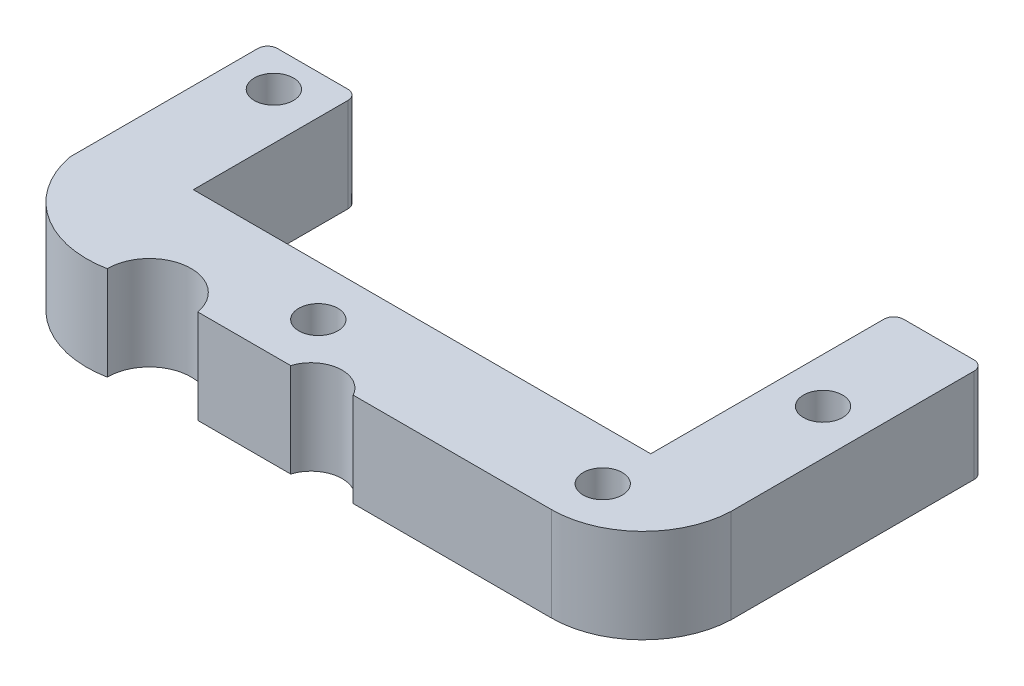
ISO-10303-21;
HEADER;
FILE_DESCRIPTION(('STEP AP214'),'2;1');
FILE_NAME('part.step','',(''),(''),'','','');
FILE_SCHEMA(('AUTOMOTIVE_DESIGN { 1 0 10303 214 1 1 1 1 }'));
ENDSEC;
DATA;
#1=APPLICATION_CONTEXT('core data for automotive mechanical design processes');
#2=APPLICATION_PROTOCOL_DEFINITION('international standard','automotive_design',2000,#1);
#3=PRODUCT_CONTEXT('',#1,'mechanical');
#4=PRODUCT('Part','Part','',(#3));
#5=PRODUCT_RELATED_PRODUCT_CATEGORY('part','',(#4));
#6=PRODUCT_DEFINITION_FORMATION('','',#4);
#7=PRODUCT_DEFINITION_CONTEXT('part definition',#1,'design');
#8=PRODUCT_DEFINITION('design','',#6,#7);
#9=PRODUCT_DEFINITION_SHAPE('','',#8);
#10=(LENGTH_UNIT() NAMED_UNIT(*) SI_UNIT(.MILLI.,.METRE.));
#11=(NAMED_UNIT(*) PLANE_ANGLE_UNIT() SI_UNIT($,.RADIAN.));
#12=(NAMED_UNIT(*) SI_UNIT($,.STERADIAN.) SOLID_ANGLE_UNIT());
#13=UNCERTAINTY_MEASURE_WITH_UNIT(LENGTH_MEASURE(1.E-05),#10,'distance_accuracy_value','');
#14=(GEOMETRIC_REPRESENTATION_CONTEXT(3) GLOBAL_UNCERTAINTY_ASSIGNED_CONTEXT((#13)) GLOBAL_UNIT_ASSIGNED_CONTEXT((#10,
#11,#12)) REPRESENTATION_CONTEXT('',''));
#15=CARTESIAN_POINT('',(0.,0.,0.));
#16=DIRECTION('',(0.,0.,1.));
#17=DIRECTION('',(1.,0.,0.));
#18=AXIS2_PLACEMENT_3D('',#15,#16,#17);
#19=CARTESIAN_POINT('',(4.6,4.8,0.));
#20=DIRECTION('',(1.,0.,0.));
#21=DIRECTION('',(0.,0.,-1.));
#22=AXIS2_PLACEMENT_3D('',#19,#20,#21);
#23=PLANE('',#22);
#24=DIRECTION('',(0.,0.,1.));
#25=VECTOR('',#24,1.);
#26=CARTESIAN_POINT('',(4.6,0.,0.));
#27=LINE('',#26,#25);
#28=CARTESIAN_POINT('',(4.6,0.,-9.60996632196429));
#29=VERTEX_POINT('',#28);
#30=CARTESIAN_POINT('',(4.6,0.,-1.71422987189018));
#31=VERTEX_POINT('',#30);
#32=EDGE_CURVE('E247',#29,#31,#27,.T.);
#33=ORIENTED_EDGE('',*,*,#32,.F.);
#34=DIRECTION('',(0.,-1.,0.));
#35=VECTOR('',#34,1.);
#36=CARTESIAN_POINT('',(4.6,4.8,-9.60996632196429));
#37=LINE('',#36,#35);
#38=CARTESIAN_POINT('',(4.6,4.8,-9.60996632196429));
#39=VERTEX_POINT('',#38);
#40=EDGE_CURVE('E54',#29,#39,#37,.F.);
#41=ORIENTED_EDGE('',*,*,#40,.T.);
#42=DIRECTION('',(0.,0.,1.));
#43=VECTOR('',#42,1.);
#44=CARTESIAN_POINT('',(4.6,4.8,0.));
#45=LINE('',#44,#43);
#46=CARTESIAN_POINT('',(4.6,4.8,-1.71422987189018));
#47=VERTEX_POINT('',#46);
#48=EDGE_CURVE('E196',#39,#47,#45,.T.);
#49=ORIENTED_EDGE('',*,*,#48,.T.);
#50=DIRECTION('',(0.,-1.,0.));
#51=VECTOR('',#50,1.);
#52=CARTESIAN_POINT('',(4.6,4.8,-1.71422987189018));
#53=LINE('',#52,#51);
#54=EDGE_CURVE('E246',#47,#31,#53,.T.);
#55=ORIENTED_EDGE('',*,*,#54,.T.);
#56=EDGE_LOOP('',(#33,#41,#49,#55));
#57=FACE_BOUND('',#56,.T.);
#58=ADVANCED_FACE('F45',(#57),#23,.T.);
#59=CARTESIAN_POINT('',(0.,4.8,-10.1099663219643));
#60=DIRECTION('',(0.,0.,-1.));
#61=DIRECTION('',(-1.,0.,0.));
#62=AXIS2_PLACEMENT_3D('',#59,#60,#61);
#63=PLANE('',#62);
#64=DIRECTION('',(1.,0.,0.));
#65=VECTOR('',#64,1.);
#66=CARTESIAN_POINT('',(0.,4.8,-10.1099663219643));
#67=LINE('',#66,#65);
#68=CARTESIAN_POINT('',(0.5,4.8,-10.1099663219643));
#69=VERTEX_POINT('',#68);
#70=CARTESIAN_POINT('',(4.1,4.8,-10.1099663219643));
#71=VERTEX_POINT('',#70);
#72=EDGE_CURVE('E192',#69,#71,#67,.T.);
#73=ORIENTED_EDGE('',*,*,#72,.T.);
#74=DIRECTION('',(0.,-1.,0.));
#75=VECTOR('',#74,1.);
#76=CARTESIAN_POINT('',(4.1,4.8,-10.1099663219643));
#77=LINE('',#76,#75);
#78=CARTESIAN_POINT('',(4.1,0.,-10.1099663219643));
#79=VERTEX_POINT('',#78);
#80=EDGE_CURVE('E372',#71,#79,#77,.T.);
#81=ORIENTED_EDGE('',*,*,#80,.T.);
#82=DIRECTION('',(1.,0.,0.));
#83=VECTOR('',#82,1.);
#84=CARTESIAN_POINT('',(0.,0.,-10.1099663219643));
#85=LINE('',#84,#83);
#86=CARTESIAN_POINT('',(0.5,0.,-10.1099663219643));
#87=VERTEX_POINT('',#86);
#88=EDGE_CURVE('E250',#87,#79,#85,.T.);
#89=ORIENTED_EDGE('',*,*,#88,.F.);
#90=DIRECTION('',(0.,-1.,0.));
#91=VECTOR('',#90,1.);
#92=CARTESIAN_POINT('',(0.5,4.8,-10.1099663219643));
#93=LINE('',#92,#91);
#94=EDGE_CURVE('E369',#87,#69,#93,.F.);
#95=ORIENTED_EDGE('',*,*,#94,.T.);
#96=EDGE_LOOP('',(#73,#81,#89,#95));
#97=FACE_BOUND('',#96,.T.);
#98=ADVANCED_FACE('F389',(#97),#63,.T.);
#99=CARTESIAN_POINT('',(0.,4.8,0.));
#100=DIRECTION('',(-1.,0.,0.));
#101=DIRECTION('',(0.,0.,1.));
#102=AXIS2_PLACEMENT_3D('',#99,#100,#101);
#103=PLANE('',#102);
#104=DIRECTION('',(0.,0.,-1.));
#105=VECTOR('',#104,1.);
#106=CARTESIAN_POINT('',(0.,4.8,0.));
#107=LINE('',#106,#105);
#108=CARTESIAN_POINT('',(0.,4.8,0.));
#109=VERTEX_POINT('',#108);
#110=CARTESIAN_POINT('',(0.,4.8,-9.60996632196429));
#111=VERTEX_POINT('',#110);
#112=EDGE_CURVE('E170',#109,#111,#107,.T.);
#113=ORIENTED_EDGE('',*,*,#112,.T.);
#114=DIRECTION('',(0.,-1.,0.));
#115=VECTOR('',#114,1.);
#116=CARTESIAN_POINT('',(0.,4.8,-9.60996632196429));
#117=LINE('',#116,#115);
#118=CARTESIAN_POINT('',(0.,0.,-9.60996632196429));
#119=VERTEX_POINT('',#118);
#120=EDGE_CURVE('E11',#111,#119,#117,.T.);
#121=ORIENTED_EDGE('',*,*,#120,.T.);
#122=DIRECTION('',(0.,0.,-1.));
#123=VECTOR('',#122,1.);
#124=CARTESIAN_POINT('',(0.,0.,0.));
#125=LINE('',#124,#123);
#126=CARTESIAN_POINT('',(0.,0.,0.));
#127=VERTEX_POINT('',#126);
#128=EDGE_CURVE('E173',#127,#119,#125,.T.);
#129=ORIENTED_EDGE('',*,*,#128,.F.);
#130=DIRECTION('',(0.,-1.,0.));
#131=VECTOR('',#130,1.);
#132=CARTESIAN_POINT('',(0.,4.8,0.));
#133=LINE('',#132,#131);
#134=EDGE_CURVE('E167',#109,#127,#133,.T.);
#135=ORIENTED_EDGE('',*,*,#134,.F.);
#136=EDGE_LOOP('',(#113,#121,#129,#135));
#137=FACE_BOUND('',#136,.T.);
#138=ADVANCED_FACE('F169',(#137),#103,.T.);
#139=CARTESIAN_POINT('',(4.93787484585662,4.8,-0.959460949687052));
#140=DIRECTION('',(0.,-1.,0.));
#141=DIRECTION('',(0.,0.,-1.));
#142=AXIS2_PLACEMENT_3D('',#139,#140,#141);
#143=CYLINDRICAL_SURFACE('',#142,5.03022596980671);
#144=CARTESIAN_POINT('',(4.93787484585662,0.,-0.959460949687052));
#145=DIRECTION('',(0.,1.,0.));
#146=DIRECTION('',(0.,0.,1.));
#147=AXIS2_PLACEMENT_3D('',#144,#145,#146);
#148=CIRCLE('',#147,5.03022596980671);
#149=CARTESIAN_POINT('',(5.89733579554364,0.,3.97841389616957));
#150=VERTEX_POINT('',#149);
#151=EDGE_CURVE('E256',#127,#150,#148,.T.);
#152=ORIENTED_EDGE('',*,*,#151,.T.);
#153=DIRECTION('',(0.,-1.,0.));
#154=VECTOR('',#153,1.);
#155=CARTESIAN_POINT('',(5.89733579554364,4.8,3.97841389616957));
#156=LINE('',#155,#154);
#157=CARTESIAN_POINT('',(5.89733579554364,4.8,3.97841389616957));
#158=VERTEX_POINT('',#157);
#159=EDGE_CURVE('E178',#158,#150,#156,.T.);
#160=ORIENTED_EDGE('',*,*,#159,.F.);
#161=CARTESIAN_POINT('',(4.93787484585662,4.8,-0.959460949687052));
#162=DIRECTION('',(0.,1.,0.));
#163=DIRECTION('',(0.,0.,1.));
#164=AXIS2_PLACEMENT_3D('',#161,#162,#163);
#165=CIRCLE('',#164,5.03022596980671);
#166=EDGE_CURVE('E181',#109,#158,#165,.T.);
#167=ORIENTED_EDGE('',*,*,#166,.F.);
#168=ORIENTED_EDGE('',*,*,#134,.T.);
#169=EDGE_LOOP('',(#152,#160,#167,#168));
#170=FACE_BOUND('',#169,.T.);
#171=ADVANCED_FACE('F182',(#170),#143,.T.);
#172=CARTESIAN_POINT('',(8.02618033173308,4.8,3.95580065369879));
#173=DIRECTION('',(0.,-1.,0.));
#174=DIRECTION('',(0.,0.,-1.));
#175=AXIS2_PLACEMENT_3D('',#172,#173,#174);
#176=CYLINDRICAL_SURFACE('',#175,2.1289646352156);
#177=CARTESIAN_POINT('',(8.02618033173308,0.,3.95580065369879));
#178=DIRECTION('',(0.,1.,0.));
#179=DIRECTION('',(0.,0.,1.));
#180=AXIS2_PLACEMENT_3D('',#177,#178,#179);
#181=CIRCLE('',#180,2.1289646352156);
#182=CARTESIAN_POINT('',(10.1218350200256,0.,3.5806715486747));
#183=VERTEX_POINT('',#182);
#184=EDGE_CURVE('E259',#150,#183,#181,.F.);
#185=ORIENTED_EDGE('',*,*,#184,.T.);
#186=DIRECTION('',(0.,-1.,0.));
#187=VECTOR('',#186,1.);
#188=CARTESIAN_POINT('',(10.1218350200256,4.8,3.5806715486747));
#189=LINE('',#188,#187);
#190=CARTESIAN_POINT('',(10.1218350200256,4.8,3.5806715486747));
#191=VERTEX_POINT('',#190);
#192=EDGE_CURVE('E328',#191,#183,#189,.T.);
#193=ORIENTED_EDGE('',*,*,#192,.F.);
#194=CARTESIAN_POINT('',(8.02618033173308,4.8,3.95580065369879));
#195=DIRECTION('',(0.,1.,0.));
#196=DIRECTION('',(0.,0.,1.));
#197=AXIS2_PLACEMENT_3D('',#194,#195,#196);
#198=CIRCLE('',#197,2.1289646352156);
#199=EDGE_CURVE('E186',#158,#191,#198,.F.);
#200=ORIENTED_EDGE('',*,*,#199,.F.);
#201=ORIENTED_EDGE('',*,*,#159,.T.);
#202=EDGE_LOOP('',(#185,#193,#200,#201));
#203=FACE_BOUND('',#202,.T.);
#204=ADVANCED_FACE('F466',(#203),#176,.F.);
#205=CARTESIAN_POINT('',(0.,4.8,3.5806715486747));
#206=DIRECTION('',(0.,0.,-1.));
#207=DIRECTION('',(-1.,0.,0.));
#208=AXIS2_PLACEMENT_3D('',#205,#206,#207);
#209=PLANE('',#208);
#210=DIRECTION('',(1.,0.,0.));
#211=VECTOR('',#210,1.);
#212=CARTESIAN_POINT('',(0.,0.,3.5806715486747));
#213=LINE('',#212,#211);
#214=CARTESIAN_POINT('',(14.8688708393998,0.,3.5806715486747));
#215=VERTEX_POINT('',#214);
#216=EDGE_CURVE('E262',#183,#215,#213,.T.);
#217=ORIENTED_EDGE('',*,*,#216,.T.);
#218=DIRECTION('',(0.,-1.,0.));
#219=VECTOR('',#218,1.);
#220=CARTESIAN_POINT('',(14.8688708393998,4.8,3.5806715486747));
#221=LINE('',#220,#219);
#222=CARTESIAN_POINT('',(14.8688708393998,4.8,3.5806715486747));
#223=VERTEX_POINT('',#222);
#224=EDGE_CURVE('E324',#223,#215,#221,.T.);
#225=ORIENTED_EDGE('',*,*,#224,.F.);
#226=DIRECTION('',(1.,0.,0.));
#227=VECTOR('',#226,1.);
#228=CARTESIAN_POINT('',(0.,4.8,3.5806715486747));
#229=LINE('',#228,#227);
#230=EDGE_CURVE('E202',#191,#223,#229,.T.);
#231=ORIENTED_EDGE('',*,*,#230,.F.);
#232=ORIENTED_EDGE('',*,*,#192,.T.);
#233=EDGE_LOOP('',(#217,#225,#231,#232));
#234=FACE_BOUND('',#233,.T.);
#235=ADVANCED_FACE('F462',(#234),#209,.F.);
#236=CARTESIAN_POINT('',(16.3811268887249,4.8,4.0511813054176));
#237=DIRECTION('',(0.,-1.,0.));
#238=DIRECTION('',(0.,0.,-1.));
#239=AXIS2_PLACEMENT_3D('',#236,#237,#238);
#240=CYLINDRICAL_SURFACE('',#239,1.58376064792333);
#241=CARTESIAN_POINT('',(16.3811268887249,0.,4.0511813054176));
#242=DIRECTION('',(0.,1.,0.));
#243=DIRECTION('',(0.,0.,1.));
#244=AXIS2_PLACEMENT_3D('',#241,#242,#243);
#245=CIRCLE('',#244,1.58376064792333);
#246=CARTESIAN_POINT('',(17.770133396356,0.,3.29028794122728));
#247=VERTEX_POINT('',#246);
#248=EDGE_CURVE('E265',#215,#247,#245,.F.);
#249=ORIENTED_EDGE('',*,*,#248,.T.);
#250=DIRECTION('',(0.,-1.,0.));
#251=VECTOR('',#250,1.);
#252=CARTESIAN_POINT('',(17.770133396356,4.8,3.29028794122728));
#253=LINE('',#252,#251);
#254=CARTESIAN_POINT('',(17.770133396356,4.8,3.29028794122728));
#255=VERTEX_POINT('',#254);
#256=EDGE_CURVE('E321',#255,#247,#253,.T.);
#257=ORIENTED_EDGE('',*,*,#256,.F.);
#258=CARTESIAN_POINT('',(16.3811268887249,4.8,4.0511813054176));
#259=DIRECTION('',(0.,1.,0.));
#260=DIRECTION('',(0.,0.,1.));
#261=AXIS2_PLACEMENT_3D('',#258,#259,#260);
#262=CIRCLE('',#261,1.58376064792333);
#263=EDGE_CURVE('E205',#223,#255,#262,.F.);
#264=ORIENTED_EDGE('',*,*,#263,.F.);
#265=ORIENTED_EDGE('',*,*,#224,.T.);
#266=EDGE_LOOP('',(#249,#257,#264,#265));
#267=FACE_BOUND('',#266,.T.);
#268=ADVANCED_FACE('F458',(#267),#240,.F.);
#269=CARTESIAN_POINT('',(0.,4.8,3.29028794122728));
#270=DIRECTION('',(0.,0.,1.));
#271=DIRECTION('',(1.,0.,0.));
#272=AXIS2_PLACEMENT_3D('',#269,#270,#271);
#273=PLANE('',#272);
#274=DIRECTION('',(-1.,0.,0.));
#275=VECTOR('',#274,1.);
#276=CARTESIAN_POINT('',(0.,0.,3.29028794122728));
#277=LINE('',#276,#275);
#278=CARTESIAN_POINT('',(27.9001753218274,0.,3.29028794122728));
#279=VERTEX_POINT('',#278);
#280=EDGE_CURVE('E269',#279,#247,#277,.T.);
#281=ORIENTED_EDGE('',*,*,#280,.F.);
#282=DIRECTION('',(0.,-1.,0.));
#283=VECTOR('',#282,1.);
#284=CARTESIAN_POINT('',(27.9001753218274,4.8,3.29028794122728));
#285=LINE('',#284,#283);
#286=CARTESIAN_POINT('',(27.9001753218274,4.8,3.29028794122728));
#287=VERTEX_POINT('',#286);
#288=EDGE_CURVE('E318',#287,#279,#285,.T.);
#289=ORIENTED_EDGE('',*,*,#288,.F.);
#290=DIRECTION('',(-1.,0.,0.));
#291=VECTOR('',#290,1.);
#292=CARTESIAN_POINT('',(0.,4.8,3.29028794122728));
#293=LINE('',#292,#291);
#294=EDGE_CURVE('E208',#287,#255,#293,.T.);
#295=ORIENTED_EDGE('',*,*,#294,.T.);
#296=ORIENTED_EDGE('',*,*,#256,.T.);
#297=EDGE_LOOP('',(#281,#289,#295,#296));
#298=FACE_BOUND('',#297,.T.);
#299=ADVANCED_FACE('F454',(#298),#273,.T.);
#300=CARTESIAN_POINT('',(27.8908657302027,4.8,-1.38919252364915));
#301=DIRECTION('',(0.,-1.,0.));
#302=DIRECTION('',(0.,0.,-1.));
#303=AXIS2_PLACEMENT_3D('',#300,#301,#302);
#304=CYLINDRICAL_SURFACE('',#303,4.67948972535002);
#305=CARTESIAN_POINT('',(27.8908657302027,0.,-1.38919252364915));
#306=DIRECTION('',(0.,1.,0.));
#307=DIRECTION('',(0.,0.,1.));
#308=AXIS2_PLACEMENT_3D('',#305,#306,#307);
#309=CIRCLE('',#308,4.67948972535002);
#310=CARTESIAN_POINT('',(32.5674438142457,0.,-1.22414249030838));
#311=VERTEX_POINT('',#310);
#312=EDGE_CURVE('E273',#311,#279,#309,.F.);
#313=ORIENTED_EDGE('',*,*,#312,.F.);
#314=DIRECTION('',(0.,-1.,0.));
#315=VECTOR('',#314,1.);
#316=CARTESIAN_POINT('',(32.5674438142457,4.8,-1.22414249030838));
#317=LINE('',#316,#315);
#318=CARTESIAN_POINT('',(32.5674438142457,4.8,-1.22414249030838));
#319=VERTEX_POINT('',#318);
#320=EDGE_CURVE('E314',#319,#311,#317,.T.);
#321=ORIENTED_EDGE('',*,*,#320,.F.);
#322=CARTESIAN_POINT('',(27.8908657302027,4.8,-1.38919252364915));
#323=DIRECTION('',(0.,1.,0.));
#324=DIRECTION('',(0.,0.,1.));
#325=AXIS2_PLACEMENT_3D('',#322,#323,#324);
#326=CIRCLE('',#325,4.67948972535002);
#327=EDGE_CURVE('E212',#319,#287,#326,.F.);
#328=ORIENTED_EDGE('',*,*,#327,.T.);
#329=ORIENTED_EDGE('',*,*,#288,.T.);
#330=EDGE_LOOP('',(#313,#321,#328,#329));
#331=FACE_BOUND('',#330,.T.);
#332=ADVANCED_FACE('F450',(#331),#304,.T.);
#333=CARTESIAN_POINT('',(32.5674438142457,4.8,0.));
#334=DIRECTION('',(1.,0.,0.));
#335=DIRECTION('',(0.,0.,-1.));
#336=AXIS2_PLACEMENT_3D('',#333,#334,#335);
#337=PLANE('',#336);
#338=DIRECTION('',(0.,0.,1.));
#339=VECTOR('',#338,1.);
#340=CARTESIAN_POINT('',(32.5674438142457,0.,0.));
#341=LINE('',#340,#339);
#342=CARTESIAN_POINT('',(32.5674438142457,0.,-13.6261329314573));
#343=VERTEX_POINT('',#342);
#344=EDGE_CURVE('E277',#343,#311,#341,.T.);
#345=ORIENTED_EDGE('',*,*,#344,.F.);
#346=DIRECTION('',(0.,-1.,0.));
#347=VECTOR('',#346,1.);
#348=CARTESIAN_POINT('',(32.5674438142457,4.8,-13.6261329314573));
#349=LINE('',#348,#347);
#350=CARTESIAN_POINT('',(32.5674438142457,4.8,-13.6261329314573));
#351=VERTEX_POINT('',#350);
#352=EDGE_CURVE('E352',#343,#351,#349,.F.);
#353=ORIENTED_EDGE('',*,*,#352,.T.);
#354=DIRECTION('',(0.,0.,1.));
#355=VECTOR('',#354,1.);
#356=CARTESIAN_POINT('',(32.5674438142457,4.8,0.));
#357=LINE('',#356,#355);
#358=EDGE_CURVE('E216',#351,#319,#357,.T.);
#359=ORIENTED_EDGE('',*,*,#358,.T.);
#360=ORIENTED_EDGE('',*,*,#320,.T.);
#361=EDGE_LOOP('',(#345,#353,#359,#360));
#362=FACE_BOUND('',#361,.T.);
#363=ADVANCED_FACE('F446',(#362),#337,.T.);
#364=CARTESIAN_POINT('',(0.,4.8,-14.1261329314573));
#365=DIRECTION('',(0.,0.,-1.));
#366=DIRECTION('',(-1.,0.,0.));
#367=AXIS2_PLACEMENT_3D('',#364,#365,#366);
#368=PLANE('',#367);
#369=DIRECTION('',(1.,0.,0.));
#370=VECTOR('',#369,1.);
#371=CARTESIAN_POINT('',(0.,4.8,-14.1261329314573));
#372=LINE('',#371,#370);
#373=CARTESIAN_POINT('',(28.4674438142457,4.8,-14.1261329314573));
#374=VERTEX_POINT('',#373);
#375=CARTESIAN_POINT('',(32.0674438142457,4.8,-14.1261329314573));
#376=VERTEX_POINT('',#375);
#377=EDGE_CURVE('E219',#374,#376,#372,.T.);
#378=ORIENTED_EDGE('',*,*,#377,.T.);
#379=DIRECTION('',(0.,-1.,0.));
#380=VECTOR('',#379,1.);
#381=CARTESIAN_POINT('',(32.0674438142457,4.8,-14.1261329314573));
#382=LINE('',#381,#380);
#383=CARTESIAN_POINT('',(32.0674438142457,0.,-14.1261329314573));
#384=VERTEX_POINT('',#383);
#385=EDGE_CURVE('E336',#376,#384,#382,.T.);
#386=ORIENTED_EDGE('',*,*,#385,.T.);
#387=DIRECTION('',(1.,0.,0.));
#388=VECTOR('',#387,1.);
#389=CARTESIAN_POINT('',(0.,0.,-14.1261329314573));
#390=LINE('',#389,#388);
#391=CARTESIAN_POINT('',(28.4674438142457,0.,-14.1261329314573));
#392=VERTEX_POINT('',#391);
#393=EDGE_CURVE('E280',#392,#384,#390,.T.);
#394=ORIENTED_EDGE('',*,*,#393,.F.);
#395=DIRECTION('',(0.,-1.,0.));
#396=VECTOR('',#395,1.);
#397=CARTESIAN_POINT('',(28.4674438142457,4.8,-14.1261329314573));
#398=LINE('',#397,#396);
#399=EDGE_CURVE('E177',#392,#374,#398,.F.);
#400=ORIENTED_EDGE('',*,*,#399,.T.);
#401=EDGE_LOOP('',(#378,#386,#394,#400));
#402=FACE_BOUND('',#401,.T.);
#403=ADVANCED_FACE('F443',(#402),#368,.T.);
#404=CARTESIAN_POINT('',(27.9674438142457,4.8,0.));
#405=DIRECTION('',(-1.,0.,0.));
#406=DIRECTION('',(0.,0.,1.));
#407=AXIS2_PLACEMENT_3D('',#404,#405,#406);
#408=PLANE('',#407);
#409=DIRECTION('',(0.,0.,-1.));
#410=VECTOR('',#409,1.);
#411=CARTESIAN_POINT('',(27.9674438142457,4.8,0.));
#412=LINE('',#411,#410);
#413=CARTESIAN_POINT('',(27.9674438142457,4.8,-1.71422987189018));
#414=VERTEX_POINT('',#413);
#415=CARTESIAN_POINT('',(27.9674438142457,4.8,-13.6261329314573));
#416=VERTEX_POINT('',#415);
#417=EDGE_CURVE('E223',#414,#416,#412,.T.);
#418=ORIENTED_EDGE('',*,*,#417,.T.);
#419=DIRECTION('',(0.,-1.,0.));
#420=VECTOR('',#419,1.);
#421=CARTESIAN_POINT('',(27.9674438142457,4.8,-13.6261329314573));
#422=LINE('',#421,#420);
#423=CARTESIAN_POINT('',(27.9674438142457,0.,-13.6261329314573));
#424=VERTEX_POINT('',#423);
#425=EDGE_CURVE('E365',#416,#424,#422,.T.);
#426=ORIENTED_EDGE('',*,*,#425,.T.);
#427=DIRECTION('',(0.,0.,-1.));
#428=VECTOR('',#427,1.);
#429=CARTESIAN_POINT('',(27.9674438142457,0.,0.));
#430=LINE('',#429,#428);
#431=CARTESIAN_POINT('',(27.9674438142457,0.,-1.71422987189018));
#432=VERTEX_POINT('',#431);
#433=EDGE_CURVE('E284',#432,#424,#430,.T.);
#434=ORIENTED_EDGE('',*,*,#433,.F.);
#435=DIRECTION('',(0.,-1.,0.));
#436=VECTOR('',#435,1.);
#437=CARTESIAN_POINT('',(27.9674438142457,4.8,-1.71422987189018));
#438=LINE('',#437,#436);
#439=EDGE_CURVE('E311',#414,#432,#438,.T.);
#440=ORIENTED_EDGE('',*,*,#439,.F.);
#441=EDGE_LOOP('',(#418,#426,#434,#440));
#442=FACE_BOUND('',#441,.T.);
#443=ADVANCED_FACE('F420',(#442),#408,.T.);
#444=CARTESIAN_POINT('',(30.2674438142457,4.8,-8.21580160077839));
#445=DIRECTION('',(0.,-1.,0.));
#446=DIRECTION('',(0.,0.,-1.));
#447=AXIS2_PLACEMENT_3D('',#444,#445,#446);
#448=CYLINDRICAL_SURFACE('',#447,0.999999999999998);
#449=CARTESIAN_POINT('',(30.2674438142457,4.8,-8.21580160077839));
#450=DIRECTION('',(0.,1.,0.));
#451=DIRECTION('',(0.,0.,1.));
#452=AXIS2_PLACEMENT_3D('',#449,#450,#451);
#453=CIRCLE('',#452,0.999999999999998);
#454=CARTESIAN_POINT('',(30.2674438142457,4.8,-7.21580160077839));
#455=VERTEX_POINT('',#454);
#456=EDGE_CURVE('E238',#455,#455,#453,.T.);
#457=ORIENTED_EDGE('',*,*,#456,.T.);
#458=EDGE_LOOP('',(#457));
#459=FACE_BOUND('',#458,.T.);
#460=CARTESIAN_POINT('',(30.2674438142457,0.,-8.21580160077839));
#461=DIRECTION('',(0.,1.,0.));
#462=DIRECTION('',(0.,0.,1.));
#463=AXIS2_PLACEMENT_3D('',#460,#461,#462);
#464=CIRCLE('',#463,0.999999999999998);
#465=CARTESIAN_POINT('',(30.2674438142457,0.,-7.21580160077839));
#466=VERTEX_POINT('',#465);
#467=EDGE_CURVE('E300',#466,#466,#464,.T.);
#468=ORIENTED_EDGE('',*,*,#467,.F.);
#469=EDGE_LOOP('',(#468));
#470=FACE_BOUND('',#469,.T.);
#471=ADVANCED_FACE('F442',(#459,#470),#448,.F.);
#472=CARTESIAN_POINT('',(28.067931627414,4.8,0.83968582627748));
#473=DIRECTION('',(0.,-1.,0.));
#474=DIRECTION('',(0.,0.,-1.));
#475=AXIS2_PLACEMENT_3D('',#472,#473,#474);
#476=CYLINDRICAL_SURFACE('',#475,1.);
#477=CARTESIAN_POINT('',(28.067931627414,4.8,0.83968582627748));
#478=DIRECTION('',(0.,1.,0.));
#479=DIRECTION('',(0.,0.,1.));
#480=AXIS2_PLACEMENT_3D('',#477,#478,#479);
#481=CIRCLE('',#480,1.);
#482=CARTESIAN_POINT('',(28.067931627414,4.8,1.83968582627748));
#483=VERTEX_POINT('',#482);
#484=EDGE_CURVE('E234',#483,#483,#481,.T.);
#485=ORIENTED_EDGE('',*,*,#484,.T.);
#486=EDGE_LOOP('',(#485));
#487=FACE_BOUND('',#486,.T.);
#488=CARTESIAN_POINT('',(28.067931627414,0.,0.83968582627748));
#489=DIRECTION('',(0.,1.,0.));
#490=DIRECTION('',(0.,0.,1.));
#491=AXIS2_PLACEMENT_3D('',#488,#489,#490);
#492=CIRCLE('',#491,1.);
#493=CARTESIAN_POINT('',(28.067931627414,0.,1.83968582627748));
#494=VERTEX_POINT('',#493);
#495=EDGE_CURVE('E296',#494,#494,#492,.T.);
#496=ORIENTED_EDGE('',*,*,#495,.F.);
#497=EDGE_LOOP('',(#496));
#498=FACE_BOUND('',#497,.T.);
#499=ADVANCED_FACE('F435',(#487,#498),#476,.F.);
#500=CARTESIAN_POINT('',(13.5392707524938,4.8,0.839685826277481));
#501=DIRECTION('',(0.,-1.,0.));
#502=DIRECTION('',(0.,0.,-1.));
#503=AXIS2_PLACEMENT_3D('',#500,#501,#502);
#504=CYLINDRICAL_SURFACE('',#503,1.);
#505=CARTESIAN_POINT('',(13.5392707524938,4.8,0.839685826277481));
#506=DIRECTION('',(0.,1.,0.));
#507=DIRECTION('',(0.,0.,1.));
#508=AXIS2_PLACEMENT_3D('',#505,#506,#507);
#509=CIRCLE('',#508,1.);
#510=CARTESIAN_POINT('',(13.5392707524938,4.8,1.83968582627748));
#511=VERTEX_POINT('',#510);
#512=EDGE_CURVE('E230',#511,#511,#509,.T.);
#513=ORIENTED_EDGE('',*,*,#512,.T.);
#514=EDGE_LOOP('',(#513));
#515=FACE_BOUND('',#514,.T.);
#516=CARTESIAN_POINT('',(13.5392707524938,0.,0.839685826277481));
#517=DIRECTION('',(0.,1.,0.));
#518=DIRECTION('',(0.,0.,1.));
#519=AXIS2_PLACEMENT_3D('',#516,#517,#518);
#520=CIRCLE('',#519,1.);
#521=CARTESIAN_POINT('',(13.5392707524938,0.,1.83968582627748));
#522=VERTEX_POINT('',#521);
#523=EDGE_CURVE('E292',#522,#522,#520,.T.);
#524=ORIENTED_EDGE('',*,*,#523,.F.);
#525=EDGE_LOOP('',(#524));
#526=FACE_BOUND('',#525,.T.);
#527=ADVANCED_FACE('F427',(#515,#526),#504,.F.);
#528=CARTESIAN_POINT('',(0.,4.8,-1.71422987189018));
#529=DIRECTION('',(0.,0.,-1.));
#530=DIRECTION('',(-1.,0.,0.));
#531=AXIS2_PLACEMENT_3D('',#528,#529,#530);
#532=PLANE('',#531);
#533=DIRECTION('',(1.,0.,0.));
#534=VECTOR('',#533,1.);
#535=CARTESIAN_POINT('',(0.,0.,-1.71422987189018));
#536=LINE('',#535,#534);
#537=EDGE_CURVE('E288',#31,#432,#536,.T.);
#538=ORIENTED_EDGE('',*,*,#537,.F.);
#539=ORIENTED_EDGE('',*,*,#54,.F.);
#540=DIRECTION('',(1.,0.,0.));
#541=VECTOR('',#540,1.);
#542=CARTESIAN_POINT('',(0.,4.8,-1.71422987189018));
#543=LINE('',#542,#541);
#544=EDGE_CURVE('E226',#47,#414,#543,.T.);
#545=ORIENTED_EDGE('',*,*,#544,.T.);
#546=ORIENTED_EDGE('',*,*,#439,.T.);
#547=EDGE_LOOP('',(#538,#539,#545,#546));
#548=FACE_BOUND('',#547,.T.);
#549=ADVANCED_FACE('F424',(#548),#532,.T.);
#550=CARTESIAN_POINT('',(2.212966764514,4.8,-8.21580160077839));
#551=DIRECTION('',(0.,-1.,0.));
#552=DIRECTION('',(0.,0.,-1.));
#553=AXIS2_PLACEMENT_3D('',#550,#551,#552);
#554=CYLINDRICAL_SURFACE('',#553,1.);
#555=CARTESIAN_POINT('',(2.212966764514,4.8,-8.21580160077839));
#556=DIRECTION('',(0.,1.,0.));
#557=DIRECTION('',(0.,0.,1.));
#558=AXIS2_PLACEMENT_3D('',#555,#556,#557);
#559=CIRCLE('',#558,1.);
#560=CARTESIAN_POINT('',(2.212966764514,4.8,-7.21580160077838));
#561=VERTEX_POINT('',#560);
#562=EDGE_CURVE('E242',#561,#561,#559,.T.);
#563=ORIENTED_EDGE('',*,*,#562,.T.);
#564=EDGE_LOOP('',(#563));
#565=FACE_BOUND('',#564,.T.);
#566=CARTESIAN_POINT('',(2.212966764514,0.,-8.21580160077839));
#567=DIRECTION('',(0.,1.,0.));
#568=DIRECTION('',(0.,0.,1.));
#569=AXIS2_PLACEMENT_3D('',#566,#567,#568);
#570=CIRCLE('',#569,1.);
#571=CARTESIAN_POINT('',(2.212966764514,0.,-7.21580160077838));
#572=VERTEX_POINT('',#571);
#573=EDGE_CURVE('E304',#572,#572,#570,.T.);
#574=ORIENTED_EDGE('',*,*,#573,.F.);
#575=EDGE_LOOP('',(#574));
#576=FACE_BOUND('',#575,.T.);
#577=ADVANCED_FACE('F426',(#565,#576),#554,.F.);
#578=CARTESIAN_POINT('',(0.,4.8,0.));
#579=DIRECTION('',(0.,1.,0.));
#580=DIRECTION('',(0.,0.,1.));
#581=AXIS2_PLACEMENT_3D('',#578,#579,#580);
#582=PLANE('',#581);
#583=ORIENTED_EDGE('',*,*,#358,.F.);
#584=CARTESIAN_POINT('',(32.0674438142457,4.8,-13.6261329314573));
#585=DIRECTION('',(0.,1.,0.));
#586=DIRECTION('',(0.,0.,1.));
#587=AXIS2_PLACEMENT_3D('',#584,#585,#586);
#588=CIRCLE('',#587,0.5);
#589=EDGE_CURVE('E362',#351,#376,#588,.T.);
#590=ORIENTED_EDGE('',*,*,#589,.T.);
#591=ORIENTED_EDGE('',*,*,#377,.F.);
#592=CARTESIAN_POINT('',(28.4674438142457,4.8,-13.6261329314573));
#593=DIRECTION('',(0.,1.,0.));
#594=DIRECTION('',(0.,0.,1.));
#595=AXIS2_PLACEMENT_3D('',#592,#593,#594);
#596=CIRCLE('',#595,0.5);
#597=EDGE_CURVE('E61',#374,#416,#596,.T.);
#598=ORIENTED_EDGE('',*,*,#597,.T.);
#599=ORIENTED_EDGE('',*,*,#417,.F.);
#600=ORIENTED_EDGE('',*,*,#544,.F.);
#601=ORIENTED_EDGE('',*,*,#48,.F.);
#602=CARTESIAN_POINT('',(4.1,4.8,-9.60996632196429));
#603=DIRECTION('',(0.,1.,0.));
#604=DIRECTION('',(0.,0.,1.));
#605=AXIS2_PLACEMENT_3D('',#602,#603,#604);
#606=CIRCLE('',#605,0.5);
#607=EDGE_CURVE('E357',#39,#71,#606,.T.);
#608=ORIENTED_EDGE('',*,*,#607,.T.);
#609=ORIENTED_EDGE('',*,*,#72,.F.);
#610=CARTESIAN_POINT('',(0.5,4.8,-9.60996632196429));
#611=DIRECTION('',(0.,1.,0.));
#612=DIRECTION('',(0.,0.,1.));
#613=AXIS2_PLACEMENT_3D('',#610,#611,#612);
#614=CIRCLE('',#613,0.5);
#615=EDGE_CURVE('E68',#69,#111,#614,.T.);
#616=ORIENTED_EDGE('',*,*,#615,.T.);
#617=ORIENTED_EDGE('',*,*,#112,.F.);
#618=ORIENTED_EDGE('',*,*,#166,.T.);
#619=ORIENTED_EDGE('',*,*,#199,.T.);
#620=ORIENTED_EDGE('',*,*,#230,.T.);
#621=ORIENTED_EDGE('',*,*,#263,.T.);
#622=ORIENTED_EDGE('',*,*,#294,.F.);
#623=ORIENTED_EDGE('',*,*,#327,.F.);
#624=EDGE_LOOP('',(#583,#590,#591,#598,#599,#600,#601,#608,#609,#616,#617,#618,#619,#620,#621,
#622,#623));
#625=FACE_BOUND('',#624,.T.);
#626=ORIENTED_EDGE('',*,*,#512,.F.);
#627=EDGE_LOOP('',(#626));
#628=FACE_BOUND('',#627,.T.);
#629=ORIENTED_EDGE('',*,*,#484,.F.);
#630=EDGE_LOOP('',(#629));
#631=FACE_BOUND('',#630,.T.);
#632=ORIENTED_EDGE('',*,*,#456,.F.);
#633=EDGE_LOOP('',(#632));
#634=FACE_BOUND('',#633,.T.);
#635=ORIENTED_EDGE('',*,*,#562,.F.);
#636=EDGE_LOOP('',(#635));
#637=FACE_BOUND('',#636,.T.);
#638=ADVANCED_FACE('F189',(#625,#628,#631,#634,#637),#582,.T.);
#639=CARTESIAN_POINT('',(0.,0.,0.));
#640=DIRECTION('',(0.,1.,0.));
#641=DIRECTION('',(0.,0.,1.));
#642=AXIS2_PLACEMENT_3D('',#639,#640,#641);
#643=PLANE('',#642);
#644=ORIENTED_EDGE('',*,*,#393,.T.);
#645=CARTESIAN_POINT('',(32.0674438142457,0.,-13.6261329314573));
#646=DIRECTION('',(0.,1.,0.));
#647=DIRECTION('',(0.,0.,1.));
#648=AXIS2_PLACEMENT_3D('',#645,#646,#647);
#649=CIRCLE('',#648,0.5);
#650=EDGE_CURVE('E349',#384,#343,#649,.F.);
#651=ORIENTED_EDGE('',*,*,#650,.T.);
#652=ORIENTED_EDGE('',*,*,#344,.T.);
#653=ORIENTED_EDGE('',*,*,#312,.T.);
#654=ORIENTED_EDGE('',*,*,#280,.T.);
#655=ORIENTED_EDGE('',*,*,#248,.F.);
#656=ORIENTED_EDGE('',*,*,#216,.F.);
#657=ORIENTED_EDGE('',*,*,#184,.F.);
#658=ORIENTED_EDGE('',*,*,#151,.F.);
#659=ORIENTED_EDGE('',*,*,#128,.T.);
#660=CARTESIAN_POINT('',(0.5,0.,-9.60996632196429));
#661=DIRECTION('',(0.,1.,0.));
#662=DIRECTION('',(0.,0.,1.));
#663=AXIS2_PLACEMENT_3D('',#660,#661,#662);
#664=CIRCLE('',#663,0.5);
#665=EDGE_CURVE('E340',#119,#87,#664,.F.);
#666=ORIENTED_EDGE('',*,*,#665,.T.);
#667=ORIENTED_EDGE('',*,*,#88,.T.);
#668=CARTESIAN_POINT('',(4.1,0.,-9.60996632196429));
#669=DIRECTION('',(0.,1.,0.));
#670=DIRECTION('',(0.,0.,1.));
#671=AXIS2_PLACEMENT_3D('',#668,#669,#670);
#672=CIRCLE('',#671,0.5);
#673=EDGE_CURVE('E343',#79,#29,#672,.F.);
#674=ORIENTED_EDGE('',*,*,#673,.T.);
#675=ORIENTED_EDGE('',*,*,#32,.T.);
#676=ORIENTED_EDGE('',*,*,#537,.T.);
#677=ORIENTED_EDGE('',*,*,#433,.T.);
#678=CARTESIAN_POINT('',(28.4674438142457,0.,-13.6261329314573));
#679=DIRECTION('',(0.,1.,0.));
#680=DIRECTION('',(0.,0.,1.));
#681=AXIS2_PLACEMENT_3D('',#678,#679,#680);
#682=CIRCLE('',#681,0.5);
#683=EDGE_CURVE('E346',#424,#392,#682,.F.);
#684=ORIENTED_EDGE('',*,*,#683,.T.);
#685=EDGE_LOOP('',(#644,#651,#652,#653,#654,#655,#656,#657,#658,#659,#666,#667,#674,#675,#676,
#677,#684));
#686=FACE_BOUND('',#685,.T.);
#687=ORIENTED_EDGE('',*,*,#523,.T.);
#688=EDGE_LOOP('',(#687));
#689=FACE_BOUND('',#688,.T.);
#690=ORIENTED_EDGE('',*,*,#495,.T.);
#691=EDGE_LOOP('',(#690));
#692=FACE_BOUND('',#691,.T.);
#693=ORIENTED_EDGE('',*,*,#467,.T.);
#694=EDGE_LOOP('',(#693));
#695=FACE_BOUND('',#694,.T.);
#696=ORIENTED_EDGE('',*,*,#573,.T.);
#697=EDGE_LOOP('',(#696));
#698=FACE_BOUND('',#697,.T.);
#699=ADVANCED_FACE('F392',(#686,#689,#692,#695,#698),#643,.F.);
#700=CARTESIAN_POINT('',(32.0674438142457,4.8,-13.6261329314573));
#701=DIRECTION('',(0.,-1.,0.));
#702=DIRECTION('',(0.,0.,-1.));
#703=AXIS2_PLACEMENT_3D('',#700,#701,#702);
#704=CYLINDRICAL_SURFACE('',#703,0.5);
#705=ORIENTED_EDGE('',*,*,#589,.F.);
#706=ORIENTED_EDGE('',*,*,#352,.F.);
#707=ORIENTED_EDGE('',*,*,#650,.F.);
#708=ORIENTED_EDGE('',*,*,#385,.F.);
#709=EDGE_LOOP('',(#705,#706,#707,#708));
#710=FACE_BOUND('',#709,.T.);
#711=ADVANCED_FACE('F408',(#710),#704,.T.);
#712=CARTESIAN_POINT('',(28.4674438142457,4.8,-13.6261329314573));
#713=DIRECTION('',(0.,-1.,0.));
#714=DIRECTION('',(0.,0.,-1.));
#715=AXIS2_PLACEMENT_3D('',#712,#713,#714);
#716=CYLINDRICAL_SURFACE('',#715,0.5);
#717=ORIENTED_EDGE('',*,*,#597,.F.);
#718=ORIENTED_EDGE('',*,*,#399,.F.);
#719=ORIENTED_EDGE('',*,*,#683,.F.);
#720=ORIENTED_EDGE('',*,*,#425,.F.);
#721=EDGE_LOOP('',(#717,#718,#719,#720));
#722=FACE_BOUND('',#721,.T.);
#723=ADVANCED_FACE('F399',(#722),#716,.T.);
#724=CARTESIAN_POINT('',(4.1,4.8,-9.60996632196429));
#725=DIRECTION('',(0.,-1.,0.));
#726=DIRECTION('',(0.,0.,-1.));
#727=AXIS2_PLACEMENT_3D('',#724,#725,#726);
#728=CYLINDRICAL_SURFACE('',#727,0.5);
#729=ORIENTED_EDGE('',*,*,#607,.F.);
#730=ORIENTED_EDGE('',*,*,#40,.F.);
#731=ORIENTED_EDGE('',*,*,#673,.F.);
#732=ORIENTED_EDGE('',*,*,#80,.F.);
#733=EDGE_LOOP('',(#729,#730,#731,#732));
#734=FACE_BOUND('',#733,.T.);
#735=ADVANCED_FACE('F386',(#734),#728,.T.);
#736=CARTESIAN_POINT('',(0.5,4.8,-9.60996632196429));
#737=DIRECTION('',(0.,-1.,0.));
#738=DIRECTION('',(0.,0.,-1.));
#739=AXIS2_PLACEMENT_3D('',#736,#737,#738);
#740=CYLINDRICAL_SURFACE('',#739,0.5);
#741=ORIENTED_EDGE('',*,*,#615,.F.);
#742=ORIENTED_EDGE('',*,*,#94,.F.);
#743=ORIENTED_EDGE('',*,*,#665,.F.);
#744=ORIENTED_EDGE('',*,*,#120,.F.);
#745=EDGE_LOOP('',(#741,#742,#743,#744));
#746=FACE_BOUND('',#745,.T.);
#747=ADVANCED_FACE('F47',(#746),#740,.T.);
#748=CLOSED_SHELL('',(#58,#98,#138,#171,#204,#235,#268,#299,#332,#363,#403,#443,#471,#499,#527,
#549,#577,#638,#699,#711,#723,#735,#747));
#749=MANIFOLD_SOLID_BREP('B2',#748);
#750=ADVANCED_BREP_SHAPE_REPRESENTATION('',(#18,#749),#14);
#751=SHAPE_DEFINITION_REPRESENTATION(#9,#750);
ENDSEC;
END-ISO-10303-21;
